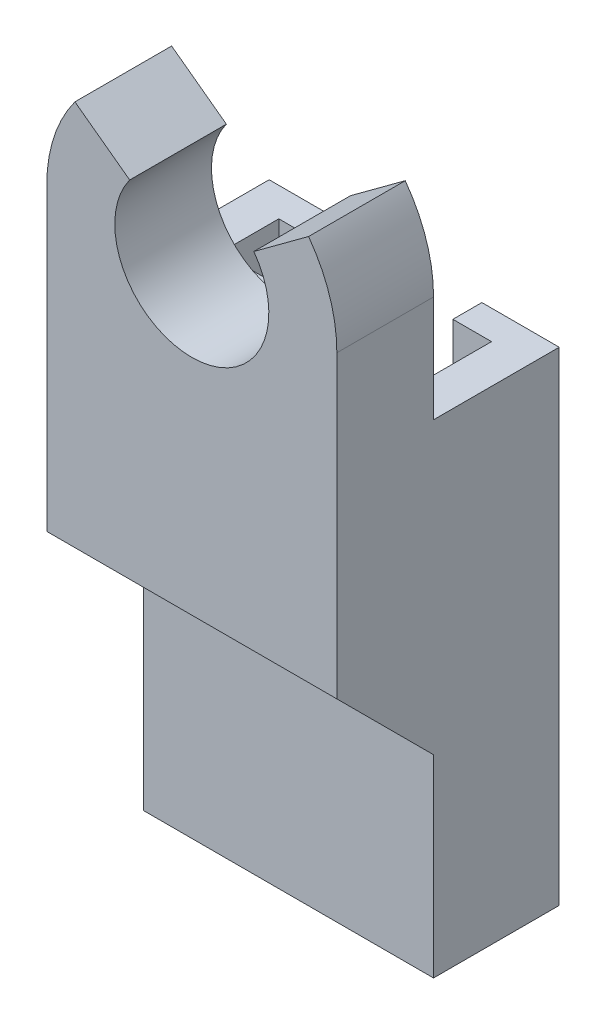
ISO-10303-21;
HEADER;
FILE_DESCRIPTION(('STEP AP214'),'2;1');
FILE_NAME('part.step','',(''),(''),'','','');
FILE_SCHEMA(('AUTOMOTIVE_DESIGN { 1 0 10303 214 1 1 1 1 }'));
ENDSEC;
DATA;
#1=APPLICATION_CONTEXT('core data for automotive mechanical design processes');
#2=APPLICATION_PROTOCOL_DEFINITION('international standard','automotive_design',2000,#1);
#3=PRODUCT_CONTEXT('',#1,'mechanical');
#4=PRODUCT('Part','Part','',(#3));
#5=PRODUCT_RELATED_PRODUCT_CATEGORY('part','',(#4));
#6=PRODUCT_DEFINITION_FORMATION('','',#4);
#7=PRODUCT_DEFINITION_CONTEXT('part definition',#1,'design');
#8=PRODUCT_DEFINITION('design','',#6,#7);
#9=PRODUCT_DEFINITION_SHAPE('','',#8);
#10=(LENGTH_UNIT() NAMED_UNIT(*) SI_UNIT(.MILLI.,.METRE.));
#11=(NAMED_UNIT(*) PLANE_ANGLE_UNIT() SI_UNIT($,.RADIAN.));
#12=(NAMED_UNIT(*) SI_UNIT($,.STERADIAN.) SOLID_ANGLE_UNIT());
#13=UNCERTAINTY_MEASURE_WITH_UNIT(LENGTH_MEASURE(1.E-05),#10,'distance_accuracy_value','');
#14=(GEOMETRIC_REPRESENTATION_CONTEXT(3) GLOBAL_UNCERTAINTY_ASSIGNED_CONTEXT((#13)) GLOBAL_UNIT_ASSIGNED_CONTEXT((#10,
#11,#12)) REPRESENTATION_CONTEXT('',''));
#15=CARTESIAN_POINT('',(0.,0.,0.));
#16=DIRECTION('',(0.,0.,1.));
#17=DIRECTION('',(1.,0.,0.));
#18=AXIS2_PLACEMENT_3D('',#15,#16,#17);
#19=CARTESIAN_POINT('',(0.,25.,0.));
#20=DIRECTION('',(0.,0.,-1.));
#21=DIRECTION('',(-1.,0.,0.));
#22=AXIS2_PLACEMENT_3D('',#19,#20,#21);
#23=PLANE('',#22);
#24=DIRECTION('',(0.,-1.,0.));
#25=VECTOR('',#24,1.);
#26=CARTESIAN_POINT('',(15.,25.,0.));
#27=LINE('',#26,#25);
#28=CARTESIAN_POINT('',(15.,10.0000000000001,0.));
#29=VERTEX_POINT('',#28);
#30=CARTESIAN_POINT('',(15.,0.,0.));
#31=VERTEX_POINT('',#30);
#32=EDGE_CURVE('E43',#29,#31,#27,.T.);
#33=ORIENTED_EDGE('',*,*,#32,.F.);
#34=DIRECTION('',(1.,0.,0.));
#35=VECTOR('',#34,1.);
#36=CARTESIAN_POINT('',(-7.07106781186539,10.0000000000001,0.));
#37=LINE('',#36,#35);
#38=CARTESIAN_POINT('',(0.,10.0000000000001,0.));
#39=VERTEX_POINT('',#38);
#40=EDGE_CURVE('E426',#39,#29,#37,.T.);
#41=ORIENTED_EDGE('',*,*,#40,.F.);
#42=DIRECTION('',(0.,-1.,0.));
#43=VECTOR('',#42,1.);
#44=CARTESIAN_POINT('',(0.,25.,0.));
#45=LINE('',#44,#43);
#46=CARTESIAN_POINT('',(0.,0.,0.));
#47=VERTEX_POINT('',#46);
#48=EDGE_CURVE('E11',#39,#47,#45,.T.);
#49=ORIENTED_EDGE('',*,*,#48,.T.);
#50=DIRECTION('',(1.,0.,0.));
#51=VECTOR('',#50,1.);
#52=CARTESIAN_POINT('',(0.,0.,0.));
#53=LINE('',#52,#51);
#54=EDGE_CURVE('E160',#47,#31,#53,.T.);
#55=ORIENTED_EDGE('',*,*,#54,.T.);
#56=EDGE_LOOP('',(#33,#41,#49,#55));
#57=FACE_BOUND('',#56,.T.);
#58=ADVANCED_FACE('F33',(#57),#23,.F.);
#59=CARTESIAN_POINT('',(0.,25.,-6.5));
#60=DIRECTION('',(1.,0.,0.));
#61=DIRECTION('',(0.,0.,-1.));
#62=AXIS2_PLACEMENT_3D('',#59,#60,#61);
#63=PLANE('',#62);
#64=ORIENTED_EDGE('',*,*,#48,.F.);
#65=DIRECTION('',(0.,0.707106781186539,0.707106781186556));
#66=VECTOR('',#65,1.);
#67=CARTESIAN_POINT('',(0.,15.,5.00000000000001));
#68=LINE('',#67,#66);
#69=CARTESIAN_POINT('',(0.,15.,5.));
#70=VERTEX_POINT('',#69);
#71=EDGE_CURVE('E422',#39,#70,#68,.T.);
#72=ORIENTED_EDGE('',*,*,#71,.T.);
#73=DIRECTION('',(0.,-1.,0.));
#74=VECTOR('',#73,1.);
#75=CARTESIAN_POINT('',(0.,28.2915536177271,5.));
#76=LINE('',#75,#74);
#77=CARTESIAN_POINT('',(0.,30.5,5.));
#78=VERTEX_POINT('',#77);
#79=EDGE_CURVE('E458',#78,#70,#76,.T.);
#80=ORIENTED_EDGE('',*,*,#79,.F.);
#81=DIRECTION('',(0.,0.,-1.));
#82=VECTOR('',#81,1.);
#83=CARTESIAN_POINT('',(0.,30.5,5.));
#84=LINE('',#83,#82);
#85=CARTESIAN_POINT('',(0.,30.5,0.));
#86=VERTEX_POINT('',#85);
#87=EDGE_CURVE('E461',#78,#86,#84,.T.);
#88=ORIENTED_EDGE('',*,*,#87,.T.);
#89=DIRECTION('',(0.,-1.,0.));
#90=VECTOR('',#89,1.);
#91=CARTESIAN_POINT('',(0.,15.,0.));
#92=LINE('',#91,#90);
#93=CARTESIAN_POINT('',(0.,25.,0.));
#94=VERTEX_POINT('',#93);
#95=EDGE_CURVE('E218',#86,#94,#92,.T.);
#96=ORIENTED_EDGE('',*,*,#95,.T.);
#97=DIRECTION('',(0.,0.,1.));
#98=VECTOR('',#97,1.);
#99=CARTESIAN_POINT('',(0.,25.,-6.5));
#100=LINE('',#99,#98);
#101=CARTESIAN_POINT('',(0.,25.,-6.5));
#102=VERTEX_POINT('',#101);
#103=EDGE_CURVE('E104',#102,#94,#100,.T.);
#104=ORIENTED_EDGE('',*,*,#103,.F.);
#105=DIRECTION('',(0.,-1.,0.));
#106=VECTOR('',#105,1.);
#107=CARTESIAN_POINT('',(0.,25.,-6.5));
#108=LINE('',#107,#106);
#109=CARTESIAN_POINT('',(0.,0.,-6.5));
#110=VERTEX_POINT('',#109);
#111=EDGE_CURVE('E153',#102,#110,#108,.T.);
#112=ORIENTED_EDGE('',*,*,#111,.T.);
#113=DIRECTION('',(0.,0.,1.));
#114=VECTOR('',#113,1.);
#115=CARTESIAN_POINT('',(0.,0.,-6.5));
#116=LINE('',#115,#114);
#117=EDGE_CURVE('E157',#110,#47,#116,.T.);
#118=ORIENTED_EDGE('',*,*,#117,.T.);
#119=EDGE_LOOP('',(#64,#72,#80,#88,#96,#104,#112,#118));
#120=FACE_BOUND('',#119,.T.);
#121=ADVANCED_FACE('F35',(#120),#63,.F.);
#122=CARTESIAN_POINT('',(15.,25.,0.));
#123=DIRECTION('',(-1.,0.,0.));
#124=DIRECTION('',(0.,0.,1.));
#125=AXIS2_PLACEMENT_3D('',#122,#123,#124);
#126=PLANE('',#125);
#127=DIRECTION('',(0.,-0.707106781186539,-0.707106781186556));
#128=VECTOR('',#127,1.);
#129=CARTESIAN_POINT('',(15.,15.,5.));
#130=LINE('',#129,#128);
#131=CARTESIAN_POINT('',(15.,15.,5.));
#132=VERTEX_POINT('',#131);
#133=EDGE_CURVE('E436',#132,#29,#130,.T.);
#134=ORIENTED_EDGE('',*,*,#133,.T.);
#135=ORIENTED_EDGE('',*,*,#32,.T.);
#136=DIRECTION('',(0.,0.,-1.));
#137=VECTOR('',#136,1.);
#138=CARTESIAN_POINT('',(15.,0.,0.));
#139=LINE('',#138,#137);
#140=CARTESIAN_POINT('',(15.,0.,-6.5));
#141=VERTEX_POINT('',#140);
#142=EDGE_CURVE('E164',#31,#141,#139,.T.);
#143=ORIENTED_EDGE('',*,*,#142,.T.);
#144=DIRECTION('',(0.,-1.,0.));
#145=VECTOR('',#144,1.);
#146=CARTESIAN_POINT('',(15.,25.,-6.5));
#147=LINE('',#146,#145);
#148=CARTESIAN_POINT('',(15.,25.,-6.5));
#149=VERTEX_POINT('',#148);
#150=EDGE_CURVE('E199',#149,#141,#147,.T.);
#151=ORIENTED_EDGE('',*,*,#150,.F.);
#152=DIRECTION('',(0.,0.,-1.));
#153=VECTOR('',#152,1.);
#154=CARTESIAN_POINT('',(15.,25.,0.));
#155=LINE('',#154,#153);
#156=CARTESIAN_POINT('',(15.,25.,0.));
#157=VERTEX_POINT('',#156);
#158=EDGE_CURVE('E208',#157,#149,#155,.T.);
#159=ORIENTED_EDGE('',*,*,#158,.F.);
#160=DIRECTION('',(0.,1.,0.));
#161=VECTOR('',#160,1.);
#162=CARTESIAN_POINT('',(15.,28.2915536177271,0.));
#163=LINE('',#162,#161);
#164=CARTESIAN_POINT('',(15.,30.5,0.));
#165=VERTEX_POINT('',#164);
#166=EDGE_CURVE('E434',#157,#165,#163,.T.);
#167=ORIENTED_EDGE('',*,*,#166,.T.);
#168=DIRECTION('',(0.,0.,-1.));
#169=VECTOR('',#168,1.);
#170=CARTESIAN_POINT('',(15.,30.5,5.));
#171=LINE('',#170,#169);
#172=CARTESIAN_POINT('',(15.,30.5,5.));
#173=VERTEX_POINT('',#172);
#174=EDGE_CURVE('E161',#173,#165,#171,.T.);
#175=ORIENTED_EDGE('',*,*,#174,.F.);
#176=DIRECTION('',(0.,1.,0.));
#177=VECTOR('',#176,1.);
#178=CARTESIAN_POINT('',(15.,25.,5.));
#179=LINE('',#178,#177);
#180=EDGE_CURVE('E440',#132,#173,#179,.T.);
#181=ORIENTED_EDGE('',*,*,#180,.F.);
#182=EDGE_LOOP('',(#134,#135,#143,#151,#159,#167,#175,#181));
#183=FACE_BOUND('',#182,.T.);
#184=ADVANCED_FACE('F264',(#183),#126,.F.);
#185=CARTESIAN_POINT('',(15.,25.,-6.5));
#186=DIRECTION('',(0.,0.,1.));
#187=DIRECTION('',(1.,0.,0.));
#188=AXIS2_PLACEMENT_3D('',#185,#186,#187);
#189=PLANE('',#188);
#190=DIRECTION('',(-1.,0.,0.));
#191=VECTOR('',#190,1.);
#192=CARTESIAN_POINT('',(15.,0.,-6.5));
#193=LINE('',#192,#191);
#194=CARTESIAN_POINT('',(11.,0.,-6.5));
#195=VERTEX_POINT('',#194);
#196=EDGE_CURVE('E166',#141,#195,#193,.T.);
#197=ORIENTED_EDGE('',*,*,#196,.T.);
#198=DIRECTION('',(0.,-1.,0.));
#199=VECTOR('',#198,1.);
#200=CARTESIAN_POINT('',(11.,25.,-6.5));
#201=LINE('',#200,#199);
#202=CARTESIAN_POINT('',(11.,25.,-6.5));
#203=VERTEX_POINT('',#202);
#204=EDGE_CURVE('E196',#203,#195,#201,.T.);
#205=ORIENTED_EDGE('',*,*,#204,.F.);
#206=DIRECTION('',(-1.,0.,0.));
#207=VECTOR('',#206,1.);
#208=CARTESIAN_POINT('',(15.,25.,-6.5));
#209=LINE('',#208,#207);
#210=EDGE_CURVE('E210',#149,#203,#209,.T.);
#211=ORIENTED_EDGE('',*,*,#210,.F.);
#212=ORIENTED_EDGE('',*,*,#150,.T.);
#213=EDGE_LOOP('',(#197,#205,#211,#212));
#214=FACE_BOUND('',#213,.T.);
#215=ADVANCED_FACE('F269',(#214),#189,.F.);
#216=CARTESIAN_POINT('',(11.,25.,-6.5));
#217=DIRECTION('',(1.,0.,0.));
#218=DIRECTION('',(0.,0.,-1.));
#219=AXIS2_PLACEMENT_3D('',#216,#217,#218);
#220=PLANE('',#219);
#221=DIRECTION('',(0.,0.,1.));
#222=VECTOR('',#221,1.);
#223=CARTESIAN_POINT('',(11.,0.,-6.5));
#224=LINE('',#223,#222);
#225=CARTESIAN_POINT('',(11.,0.,-5.));
#226=VERTEX_POINT('',#225);
#227=EDGE_CURVE('E168',#195,#226,#224,.T.);
#228=ORIENTED_EDGE('',*,*,#227,.T.);
#229=DIRECTION('',(0.,-1.,0.));
#230=VECTOR('',#229,1.);
#231=CARTESIAN_POINT('',(11.,25.,-5.));
#232=LINE('',#231,#230);
#233=CARTESIAN_POINT('',(11.,25.,-5.));
#234=VERTEX_POINT('',#233);
#235=EDGE_CURVE('E193',#234,#226,#232,.T.);
#236=ORIENTED_EDGE('',*,*,#235,.F.);
#237=DIRECTION('',(0.,0.,1.));
#238=VECTOR('',#237,1.);
#239=CARTESIAN_POINT('',(11.,25.,-6.5));
#240=LINE('',#239,#238);
#241=EDGE_CURVE('E222',#203,#234,#240,.T.);
#242=ORIENTED_EDGE('',*,*,#241,.F.);
#243=ORIENTED_EDGE('',*,*,#204,.T.);
#244=EDGE_LOOP('',(#228,#236,#242,#243));
#245=FACE_BOUND('',#244,.T.);
#246=ADVANCED_FACE('F273',(#245),#220,.F.);
#247=CARTESIAN_POINT('',(11.,25.,-5.));
#248=DIRECTION('',(0.,0.,-1.));
#249=DIRECTION('',(-1.,0.,0.));
#250=AXIS2_PLACEMENT_3D('',#247,#248,#249);
#251=PLANE('',#250);
#252=DIRECTION('',(1.,0.,0.));
#253=VECTOR('',#252,1.);
#254=CARTESIAN_POINT('',(11.,0.,-5.));
#255=LINE('',#254,#253);
#256=CARTESIAN_POINT('',(13.,0.,-5.));
#257=VERTEX_POINT('',#256);
#258=EDGE_CURVE('E170',#226,#257,#255,.T.);
#259=ORIENTED_EDGE('',*,*,#258,.T.);
#260=DIRECTION('',(0.,-1.,0.));
#261=VECTOR('',#260,1.);
#262=CARTESIAN_POINT('',(13.,25.,-5.));
#263=LINE('',#262,#261);
#264=CARTESIAN_POINT('',(13.,25.,-5.));
#265=VERTEX_POINT('',#264);
#266=EDGE_CURVE('E190',#265,#257,#263,.T.);
#267=ORIENTED_EDGE('',*,*,#266,.F.);
#268=DIRECTION('',(1.,0.,0.));
#269=VECTOR('',#268,1.);
#270=CARTESIAN_POINT('',(11.,25.,-5.));
#271=LINE('',#270,#269);
#272=EDGE_CURVE('E224',#234,#265,#271,.T.);
#273=ORIENTED_EDGE('',*,*,#272,.F.);
#274=ORIENTED_EDGE('',*,*,#235,.T.);
#275=EDGE_LOOP('',(#259,#267,#273,#274));
#276=FACE_BOUND('',#275,.T.);
#277=ADVANCED_FACE('F277',(#276),#251,.F.);
#278=CARTESIAN_POINT('',(13.,25.,-5.));
#279=DIRECTION('',(1.,0.,0.));
#280=DIRECTION('',(0.,0.,-1.));
#281=AXIS2_PLACEMENT_3D('',#278,#279,#280);
#282=PLANE('',#281);
#283=DIRECTION('',(0.,0.,1.));
#284=VECTOR('',#283,1.);
#285=CARTESIAN_POINT('',(13.,0.,-5.));
#286=LINE('',#285,#284);
#287=CARTESIAN_POINT('',(13.,0.,-2.));
#288=VERTEX_POINT('',#287);
#289=EDGE_CURVE('E172',#257,#288,#286,.T.);
#290=ORIENTED_EDGE('',*,*,#289,.T.);
#291=DIRECTION('',(0.,-1.,0.));
#292=VECTOR('',#291,1.);
#293=CARTESIAN_POINT('',(13.,25.,-2.));
#294=LINE('',#293,#292);
#295=CARTESIAN_POINT('',(13.,25.,-2.));
#296=VERTEX_POINT('',#295);
#297=EDGE_CURVE('E187',#296,#288,#294,.T.);
#298=ORIENTED_EDGE('',*,*,#297,.F.);
#299=DIRECTION('',(0.,0.,1.));
#300=VECTOR('',#299,1.);
#301=CARTESIAN_POINT('',(13.,25.,-5.));
#302=LINE('',#301,#300);
#303=EDGE_CURVE('E226',#265,#296,#302,.T.);
#304=ORIENTED_EDGE('',*,*,#303,.F.);
#305=ORIENTED_EDGE('',*,*,#266,.T.);
#306=EDGE_LOOP('',(#290,#298,#304,#305));
#307=FACE_BOUND('',#306,.T.);
#308=ADVANCED_FACE('F281',(#307),#282,.F.);
#309=CARTESIAN_POINT('',(13.,25.,-2.));
#310=DIRECTION('',(0.,0.,1.));
#311=DIRECTION('',(1.,0.,0.));
#312=AXIS2_PLACEMENT_3D('',#309,#310,#311);
#313=PLANE('',#312);
#314=DIRECTION('',(-1.,0.,0.));
#315=VECTOR('',#314,1.);
#316=CARTESIAN_POINT('',(13.,0.,-2.));
#317=LINE('',#316,#315);
#318=CARTESIAN_POINT('',(2.,0.,-2.));
#319=VERTEX_POINT('',#318);
#320=EDGE_CURVE('E174',#288,#319,#317,.T.);
#321=ORIENTED_EDGE('',*,*,#320,.T.);
#322=DIRECTION('',(0.,-1.,0.));
#323=VECTOR('',#322,1.);
#324=CARTESIAN_POINT('',(2.,25.,-2.));
#325=LINE('',#324,#323);
#326=CARTESIAN_POINT('',(2.,25.,-2.));
#327=VERTEX_POINT('',#326);
#328=EDGE_CURVE('E184',#327,#319,#325,.T.);
#329=ORIENTED_EDGE('',*,*,#328,.F.);
#330=DIRECTION('',(-1.,0.,0.));
#331=VECTOR('',#330,1.);
#332=CARTESIAN_POINT('',(13.,25.,-2.));
#333=LINE('',#332,#331);
#334=EDGE_CURVE('E228',#296,#327,#333,.T.);
#335=ORIENTED_EDGE('',*,*,#334,.F.);
#336=ORIENTED_EDGE('',*,*,#297,.T.);
#337=EDGE_LOOP('',(#321,#329,#335,#336));
#338=FACE_BOUND('',#337,.T.);
#339=ADVANCED_FACE('F234',(#338),#313,.F.);
#340=CARTESIAN_POINT('',(2.,25.,-2.));
#341=DIRECTION('',(-1.,0.,0.));
#342=DIRECTION('',(0.,0.,1.));
#343=AXIS2_PLACEMENT_3D('',#340,#341,#342);
#344=PLANE('',#343);
#345=DIRECTION('',(0.,0.,-1.));
#346=VECTOR('',#345,1.);
#347=CARTESIAN_POINT('',(2.,0.,-2.));
#348=LINE('',#347,#346);
#349=CARTESIAN_POINT('',(2.,0.,-5.));
#350=VERTEX_POINT('',#349);
#351=EDGE_CURVE('E176',#319,#350,#348,.T.);
#352=ORIENTED_EDGE('',*,*,#351,.T.);
#353=DIRECTION('',(0.,-1.,0.));
#354=VECTOR('',#353,1.);
#355=CARTESIAN_POINT('',(2.,25.,-5.));
#356=LINE('',#355,#354);
#357=CARTESIAN_POINT('',(2.,25.,-5.));
#358=VERTEX_POINT('',#357);
#359=EDGE_CURVE('E148',#358,#350,#356,.T.);
#360=ORIENTED_EDGE('',*,*,#359,.F.);
#361=DIRECTION('',(0.,0.,-1.));
#362=VECTOR('',#361,1.);
#363=CARTESIAN_POINT('',(2.,25.,-2.));
#364=LINE('',#363,#362);
#365=EDGE_CURVE('E139',#327,#358,#364,.T.);
#366=ORIENTED_EDGE('',*,*,#365,.F.);
#367=ORIENTED_EDGE('',*,*,#328,.T.);
#368=EDGE_LOOP('',(#352,#360,#366,#367));
#369=FACE_BOUND('',#368,.T.);
#370=ADVANCED_FACE('F238',(#369),#344,.F.);
#371=CARTESIAN_POINT('',(2.,25.,-5.));
#372=DIRECTION('',(0.,0.,-1.));
#373=DIRECTION('',(-1.,0.,0.));
#374=AXIS2_PLACEMENT_3D('',#371,#372,#373);
#375=PLANE('',#374);
#376=DIRECTION('',(1.,0.,0.));
#377=VECTOR('',#376,1.);
#378=CARTESIAN_POINT('',(2.,0.,-5.));
#379=LINE('',#378,#377);
#380=CARTESIAN_POINT('',(4.,0.,-5.));
#381=VERTEX_POINT('',#380);
#382=EDGE_CURVE('E147',#350,#381,#379,.T.);
#383=ORIENTED_EDGE('',*,*,#382,.T.);
#384=DIRECTION('',(0.,-1.,0.));
#385=VECTOR('',#384,1.);
#386=CARTESIAN_POINT('',(4.,25.,-5.));
#387=LINE('',#386,#385);
#388=CARTESIAN_POINT('',(4.,25.,-5.));
#389=VERTEX_POINT('',#388);
#390=EDGE_CURVE('E144',#389,#381,#387,.T.);
#391=ORIENTED_EDGE('',*,*,#390,.F.);
#392=DIRECTION('',(1.,0.,0.));
#393=VECTOR('',#392,1.);
#394=CARTESIAN_POINT('',(2.,25.,-5.));
#395=LINE('',#394,#393);
#396=EDGE_CURVE('E133',#358,#389,#395,.T.);
#397=ORIENTED_EDGE('',*,*,#396,.F.);
#398=ORIENTED_EDGE('',*,*,#359,.T.);
#399=EDGE_LOOP('',(#383,#391,#397,#398));
#400=FACE_BOUND('',#399,.T.);
#401=ADVANCED_FACE('F145',(#400),#375,.F.);
#402=CARTESIAN_POINT('',(4.,25.,-5.));
#403=DIRECTION('',(-1.,0.,0.));
#404=DIRECTION('',(0.,0.,1.));
#405=AXIS2_PLACEMENT_3D('',#402,#403,#404);
#406=PLANE('',#405);
#407=DIRECTION('',(0.,0.,-1.));
#408=VECTOR('',#407,1.);
#409=CARTESIAN_POINT('',(4.,0.,-5.));
#410=LINE('',#409,#408);
#411=CARTESIAN_POINT('',(4.,0.,-6.5));
#412=VERTEX_POINT('',#411);
#413=EDGE_CURVE('E92',#381,#412,#410,.T.);
#414=ORIENTED_EDGE('',*,*,#413,.T.);
#415=DIRECTION('',(0.,-1.,0.));
#416=VECTOR('',#415,1.);
#417=CARTESIAN_POINT('',(4.,25.,-6.5));
#418=LINE('',#417,#416);
#419=CARTESIAN_POINT('',(4.,25.,-6.5));
#420=VERTEX_POINT('',#419);
#421=EDGE_CURVE('E149',#420,#412,#418,.T.);
#422=ORIENTED_EDGE('',*,*,#421,.F.);
#423=DIRECTION('',(0.,0.,-1.));
#424=VECTOR('',#423,1.);
#425=CARTESIAN_POINT('',(4.,25.,-5.));
#426=LINE('',#425,#424);
#427=EDGE_CURVE('E137',#389,#420,#426,.T.);
#428=ORIENTED_EDGE('',*,*,#427,.F.);
#429=ORIENTED_EDGE('',*,*,#390,.T.);
#430=EDGE_LOOP('',(#414,#422,#428,#429));
#431=FACE_BOUND('',#430,.T.);
#432=ADVANCED_FACE('F151',(#431),#406,.F.);
#433=CARTESIAN_POINT('',(4.,25.,-6.5));
#434=DIRECTION('',(0.,0.,1.));
#435=DIRECTION('',(1.,0.,0.));
#436=AXIS2_PLACEMENT_3D('',#433,#434,#435);
#437=PLANE('',#436);
#438=DIRECTION('',(-1.,0.,0.));
#439=VECTOR('',#438,1.);
#440=CARTESIAN_POINT('',(4.,0.,-6.5));
#441=LINE('',#440,#439);
#442=EDGE_CURVE('E98',#412,#110,#441,.T.);
#443=ORIENTED_EDGE('',*,*,#442,.T.);
#444=ORIENTED_EDGE('',*,*,#111,.F.);
#445=DIRECTION('',(-1.,0.,0.));
#446=VECTOR('',#445,1.);
#447=CARTESIAN_POINT('',(4.,25.,-6.5));
#448=LINE('',#447,#446);
#449=EDGE_CURVE('E51',#420,#102,#448,.T.);
#450=ORIENTED_EDGE('',*,*,#449,.F.);
#451=ORIENTED_EDGE('',*,*,#421,.T.);
#452=EDGE_LOOP('',(#443,#444,#450,#451));
#453=FACE_BOUND('',#452,.T.);
#454=ADVANCED_FACE('F249',(#453),#437,.F.);
#455=CARTESIAN_POINT('',(0.,25.,0.));
#456=DIRECTION('',(0.,1.,0.));
#457=DIRECTION('',(0.,0.,1.));
#458=AXIS2_PLACEMENT_3D('',#455,#456,#457);
#459=PLANE('',#458);
#460=ORIENTED_EDGE('',*,*,#103,.T.);
#461=DIRECTION('',(1.,0.,0.));
#462=VECTOR('',#461,1.);
#463=CARTESIAN_POINT('',(0.,25.,0.));
#464=LINE('',#463,#462);
#465=EDGE_CURVE('E211',#94,#157,#464,.T.);
#466=ORIENTED_EDGE('',*,*,#465,.T.);
#467=ORIENTED_EDGE('',*,*,#158,.T.);
#468=ORIENTED_EDGE('',*,*,#210,.T.);
#469=ORIENTED_EDGE('',*,*,#241,.T.);
#470=ORIENTED_EDGE('',*,*,#272,.T.);
#471=ORIENTED_EDGE('',*,*,#303,.T.);
#472=ORIENTED_EDGE('',*,*,#334,.T.);
#473=ORIENTED_EDGE('',*,*,#365,.T.);
#474=ORIENTED_EDGE('',*,*,#396,.T.);
#475=ORIENTED_EDGE('',*,*,#427,.T.);
#476=ORIENTED_EDGE('',*,*,#449,.T.);
#477=EDGE_LOOP('',(#460,#466,#467,#468,#469,#470,#471,#472,#473,#474,#475,#476));
#478=FACE_BOUND('',#477,.T.);
#479=ADVANCED_FACE('F135',(#478),#459,.T.);
#480=CARTESIAN_POINT('',(0.,0.,0.));
#481=DIRECTION('',(0.,1.,0.));
#482=DIRECTION('',(0.,0.,1.));
#483=AXIS2_PLACEMENT_3D('',#480,#481,#482);
#484=PLANE('',#483);
#485=ORIENTED_EDGE('',*,*,#117,.F.);
#486=ORIENTED_EDGE('',*,*,#442,.F.);
#487=ORIENTED_EDGE('',*,*,#413,.F.);
#488=ORIENTED_EDGE('',*,*,#382,.F.);
#489=ORIENTED_EDGE('',*,*,#351,.F.);
#490=ORIENTED_EDGE('',*,*,#320,.F.);
#491=ORIENTED_EDGE('',*,*,#289,.F.);
#492=ORIENTED_EDGE('',*,*,#258,.F.);
#493=ORIENTED_EDGE('',*,*,#227,.F.);
#494=ORIENTED_EDGE('',*,*,#196,.F.);
#495=ORIENTED_EDGE('',*,*,#142,.F.);
#496=ORIENTED_EDGE('',*,*,#54,.F.);
#497=EDGE_LOOP('',(#485,#486,#487,#488,#489,#490,#491,#492,#493,#494,#495,#496));
#498=FACE_BOUND('',#497,.T.);
#499=ADVANCED_FACE('F241',(#498),#484,.F.);
#500=CARTESIAN_POINT('',(7.5,30.5269082806753,0.));
#501=DIRECTION('',(0.,0.,-1.));
#502=DIRECTION('',(-1.,0.,0.));
#503=AXIS2_PLACEMENT_3D('',#500,#501,#502);
#504=PLANE('',#503);
#505=ORIENTED_EDGE('',*,*,#465,.F.);
#506=ORIENTED_EDGE('',*,*,#95,.F.);
#507=CARTESIAN_POINT('',(7.5,30.5269082806753,0.));
#508=DIRECTION('',(0.,0.,1.));
#509=DIRECTION('',(-1.,0.,0.));
#510=AXIS2_PLACEMENT_3D('',#507,#508,#509);
#511=CIRCLE('',#510,7.50004827021593);
#512=CARTESIAN_POINT('',(1.45569447508873,34.9673018192139,0.));
#513=VERTEX_POINT('',#512);
#514=EDGE_CURVE('E485',#513,#86,#511,.T.);
#515=ORIENTED_EDGE('',*,*,#514,.F.);
#516=DIRECTION('',(-0.805416707876866,0.592708972998377,0.));
#517=VECTOR('',#516,1.);
#518=CARTESIAN_POINT('',(4.28759779004632,32.8832942625991,0.));
#519=LINE('',#518,#517);
#520=CARTESIAN_POINT('',(4.28759779004632,32.8832942625991,0.));
#521=VERTEX_POINT('',#520);
#522=EDGE_CURVE('E488',#521,#513,#519,.T.);
#523=ORIENTED_EDGE('',*,*,#522,.F.);
#524=CARTESIAN_POINT('',(7.5,30.5269082806753,0.));
#525=DIRECTION('',(0.,0.,-1.));
#526=DIRECTION('',(-1.,0.,0.));
#527=AXIS2_PLACEMENT_3D('',#524,#525,#526);
#528=CIRCLE('',#527,3.98397826981055);
#529=CARTESIAN_POINT('',(10.707203961058,32.8903645647001,0.));
#530=VERTEX_POINT('',#529);
#531=EDGE_CURVE('E491',#530,#521,#528,.T.);
#532=ORIENTED_EDGE('',*,*,#531,.F.);
#533=DIRECTION('',(-0.805025465465337,-0.59324025483131,0.));
#534=VECTOR('',#533,1.);
#535=CARTESIAN_POINT('',(13.5377298497431,34.9762388277453,0.));
#536=LINE('',#535,#534);
#537=CARTESIAN_POINT('',(13.5377298497431,34.9762388277453,0.));
#538=VERTEX_POINT('',#537);
#539=EDGE_CURVE('E493',#538,#530,#536,.T.);
#540=ORIENTED_EDGE('',*,*,#539,.F.);
#541=CARTESIAN_POINT('',(7.5,30.5269082806753,0.));
#542=DIRECTION('',(0.,0.,1.));
#543=DIRECTION('',(1.,0.,0.));
#544=AXIS2_PLACEMENT_3D('',#541,#542,#543);
#545=CIRCLE('',#544,7.50004827021593);
#546=EDGE_CURVE('E464',#165,#538,#545,.T.);
#547=ORIENTED_EDGE('',*,*,#546,.F.);
#548=ORIENTED_EDGE('',*,*,#166,.F.);
#549=EDGE_LOOP('',(#505,#506,#515,#523,#532,#540,#547,#548));
#550=FACE_BOUND('',#549,.T.);
#551=ADVANCED_FACE('F313',(#550),#504,.T.);
#552=CARTESIAN_POINT('',(7.5,30.5269082806753,5.));
#553=DIRECTION('',(0.,0.,-1.));
#554=DIRECTION('',(-1.,0.,0.));
#555=AXIS2_PLACEMENT_3D('',#552,#553,#554);
#556=CYLINDRICAL_SURFACE('',#555,7.50004827021593);
#557=ORIENTED_EDGE('',*,*,#546,.T.);
#558=DIRECTION('',(0.,0.,-1.));
#559=VECTOR('',#558,1.);
#560=CARTESIAN_POINT('',(13.5377298497431,34.9762388277453,5.));
#561=LINE('',#560,#559);
#562=CARTESIAN_POINT('',(13.5377298497431,34.9762388277453,5.));
#563=VERTEX_POINT('',#562);
#564=EDGE_CURVE('E470',#563,#538,#561,.T.);
#565=ORIENTED_EDGE('',*,*,#564,.F.);
#566=CARTESIAN_POINT('',(7.5,30.5269082806753,5.));
#567=DIRECTION('',(0.,0.,1.));
#568=DIRECTION('',(1.,0.,0.));
#569=AXIS2_PLACEMENT_3D('',#566,#567,#568);
#570=CIRCLE('',#569,7.50004827021593);
#571=EDGE_CURVE('E443',#173,#563,#570,.T.);
#572=ORIENTED_EDGE('',*,*,#571,.F.);
#573=ORIENTED_EDGE('',*,*,#174,.T.);
#574=EDGE_LOOP('',(#557,#565,#572,#573));
#575=FACE_BOUND('',#574,.T.);
#576=ADVANCED_FACE('F327',(#575),#556,.T.);
#577=CARTESIAN_POINT('',(13.5377298497431,34.9762388277453,5.));
#578=DIRECTION('',(0.59324025483131,-0.805025465465337,0.));
#579=DIRECTION('',(0.805025465465337,0.59324025483131,0.));
#580=AXIS2_PLACEMENT_3D('',#577,#578,#579);
#581=PLANE('',#580);
#582=ORIENTED_EDGE('',*,*,#539,.T.);
#583=DIRECTION('',(0.,0.,-1.));
#584=VECTOR('',#583,1.);
#585=CARTESIAN_POINT('',(10.707203961058,32.8903645647001,5.));
#586=LINE('',#585,#584);
#587=CARTESIAN_POINT('',(10.707203961058,32.8903645647001,5.));
#588=VERTEX_POINT('',#587);
#589=EDGE_CURVE('E473',#588,#530,#586,.T.);
#590=ORIENTED_EDGE('',*,*,#589,.F.);
#591=DIRECTION('',(-0.805025465465337,-0.59324025483131,0.));
#592=VECTOR('',#591,1.);
#593=CARTESIAN_POINT('',(13.5377298497431,34.9762388277453,5.));
#594=LINE('',#593,#592);
#595=EDGE_CURVE('E446',#563,#588,#594,.T.);
#596=ORIENTED_EDGE('',*,*,#595,.F.);
#597=ORIENTED_EDGE('',*,*,#564,.T.);
#598=EDGE_LOOP('',(#582,#590,#596,#597));
#599=FACE_BOUND('',#598,.T.);
#600=ADVANCED_FACE('F338',(#599),#581,.F.);
#601=CARTESIAN_POINT('',(7.5,30.5269082806753,5.));
#602=DIRECTION('',(0.,0.,-1.));
#603=DIRECTION('',(-1.,0.,0.));
#604=AXIS2_PLACEMENT_3D('',#601,#602,#603);
#605=CYLINDRICAL_SURFACE('',#604,3.98397826981055);
#606=ORIENTED_EDGE('',*,*,#531,.T.);
#607=DIRECTION('',(0.,0.,-1.));
#608=VECTOR('',#607,1.);
#609=CARTESIAN_POINT('',(4.28759779004632,32.8832942625991,5.));
#610=LINE('',#609,#608);
#611=CARTESIAN_POINT('',(4.28759779004632,32.8832942625991,5.));
#612=VERTEX_POINT('',#611);
#613=EDGE_CURVE('E476',#612,#521,#610,.T.);
#614=ORIENTED_EDGE('',*,*,#613,.F.);
#615=CARTESIAN_POINT('',(7.5,30.5269082806753,5.));
#616=DIRECTION('',(0.,0.,-1.));
#617=DIRECTION('',(-1.,0.,0.));
#618=AXIS2_PLACEMENT_3D('',#615,#616,#617);
#619=CIRCLE('',#618,3.98397826981055);
#620=EDGE_CURVE('E449',#588,#612,#619,.T.);
#621=ORIENTED_EDGE('',*,*,#620,.F.);
#622=ORIENTED_EDGE('',*,*,#589,.T.);
#623=EDGE_LOOP('',(#606,#614,#621,#622));
#624=FACE_BOUND('',#623,.T.);
#625=ADVANCED_FACE('F348',(#624),#605,.F.);
#626=CARTESIAN_POINT('',(4.28759779004632,32.8832942625991,5.));
#627=DIRECTION('',(-0.592708972998377,-0.805416707876866,0.));
#628=DIRECTION('',(0.805416707876866,-0.592708972998377,0.));
#629=AXIS2_PLACEMENT_3D('',#626,#627,#628);
#630=PLANE('',#629);
#631=ORIENTED_EDGE('',*,*,#522,.T.);
#632=DIRECTION('',(0.,0.,-1.));
#633=VECTOR('',#632,1.);
#634=CARTESIAN_POINT('',(1.45569447508873,34.9673018192139,5.));
#635=LINE('',#634,#633);
#636=CARTESIAN_POINT('',(1.45569447508873,34.9673018192139,5.));
#637=VERTEX_POINT('',#636);
#638=EDGE_CURVE('E479',#637,#513,#635,.T.);
#639=ORIENTED_EDGE('',*,*,#638,.F.);
#640=DIRECTION('',(-0.805416707876866,0.592708972998377,0.));
#641=VECTOR('',#640,1.);
#642=CARTESIAN_POINT('',(4.28759779004632,32.8832942625991,5.));
#643=LINE('',#642,#641);
#644=EDGE_CURVE('E452',#612,#637,#643,.T.);
#645=ORIENTED_EDGE('',*,*,#644,.F.);
#646=ORIENTED_EDGE('',*,*,#613,.T.);
#647=EDGE_LOOP('',(#631,#639,#645,#646));
#648=FACE_BOUND('',#647,.T.);
#649=ADVANCED_FACE('F358',(#648),#630,.F.);
#650=CARTESIAN_POINT('',(7.5,30.5269082806753,5.));
#651=DIRECTION('',(0.,0.,-1.));
#652=DIRECTION('',(-1.,0.,0.));
#653=AXIS2_PLACEMENT_3D('',#650,#651,#652);
#654=CYLINDRICAL_SURFACE('',#653,7.50004827021593);
#655=ORIENTED_EDGE('',*,*,#514,.T.);
#656=ORIENTED_EDGE('',*,*,#87,.F.);
#657=CARTESIAN_POINT('',(7.5,30.5269082806753,5.));
#658=DIRECTION('',(0.,0.,1.));
#659=DIRECTION('',(-1.,0.,0.));
#660=AXIS2_PLACEMENT_3D('',#657,#658,#659);
#661=CIRCLE('',#660,7.50004827021593);
#662=EDGE_CURVE('E455',#637,#78,#661,.T.);
#663=ORIENTED_EDGE('',*,*,#662,.F.);
#664=ORIENTED_EDGE('',*,*,#638,.T.);
#665=EDGE_LOOP('',(#655,#656,#663,#664));
#666=FACE_BOUND('',#665,.T.);
#667=ADVANCED_FACE('F368',(#666),#654,.T.);
#668=CARTESIAN_POINT('',(7.5,30.5269082806753,5.));
#669=DIRECTION('',(0.,0.,-1.));
#670=DIRECTION('',(-1.,0.,0.));
#671=AXIS2_PLACEMENT_3D('',#668,#669,#670);
#672=PLANE('',#671);
#673=ORIENTED_EDGE('',*,*,#180,.T.);
#674=ORIENTED_EDGE('',*,*,#571,.T.);
#675=ORIENTED_EDGE('',*,*,#595,.T.);
#676=ORIENTED_EDGE('',*,*,#620,.T.);
#677=ORIENTED_EDGE('',*,*,#644,.T.);
#678=ORIENTED_EDGE('',*,*,#662,.T.);
#679=ORIENTED_EDGE('',*,*,#79,.T.);
#680=DIRECTION('',(1.,0.,0.));
#681=VECTOR('',#680,1.);
#682=CARTESIAN_POINT('',(15.,15.,5.));
#683=LINE('',#682,#681);
#684=EDGE_CURVE('E430',#70,#132,#683,.T.);
#685=ORIENTED_EDGE('',*,*,#684,.T.);
#686=EDGE_LOOP('',(#673,#674,#675,#676,#677,#678,#679,#685));
#687=FACE_BOUND('',#686,.T.);
#688=ADVANCED_FACE('F377',(#687),#672,.F.);
#689=CARTESIAN_POINT('',(-7.07106781186539,15.,5.00000000000001));
#690=DIRECTION('',(0.,-0.707106781186556,0.707106781186539));
#691=DIRECTION('',(0.,-0.707106781186539,-0.707106781186556));
#692=AXIS2_PLACEMENT_3D('',#689,#690,#691);
#693=PLANE('',#692);
#694=ORIENTED_EDGE('',*,*,#71,.F.);
#695=ORIENTED_EDGE('',*,*,#40,.T.);
#696=ORIENTED_EDGE('',*,*,#133,.F.);
#697=ORIENTED_EDGE('',*,*,#684,.F.);
#698=EDGE_LOOP('',(#694,#695,#696,#697));
#699=FACE_BOUND('',#698,.T.);
#700=ADVANCED_FACE('F406',(#699),#693,.T.);
#701=CLOSED_SHELL('',(#58,#121,#184,#215,#246,#277,#308,#339,#370,#401,#432,#454,#479,#499,#551,
#576,#600,#625,#649,#667,#688,#700));
#702=MANIFOLD_SOLID_BREP('B2',#701);
#703=ADVANCED_BREP_SHAPE_REPRESENTATION('',(#18,#702),#14);
#704=SHAPE_DEFINITION_REPRESENTATION(#9,#703);
ENDSEC;
END-ISO-10303-21;
